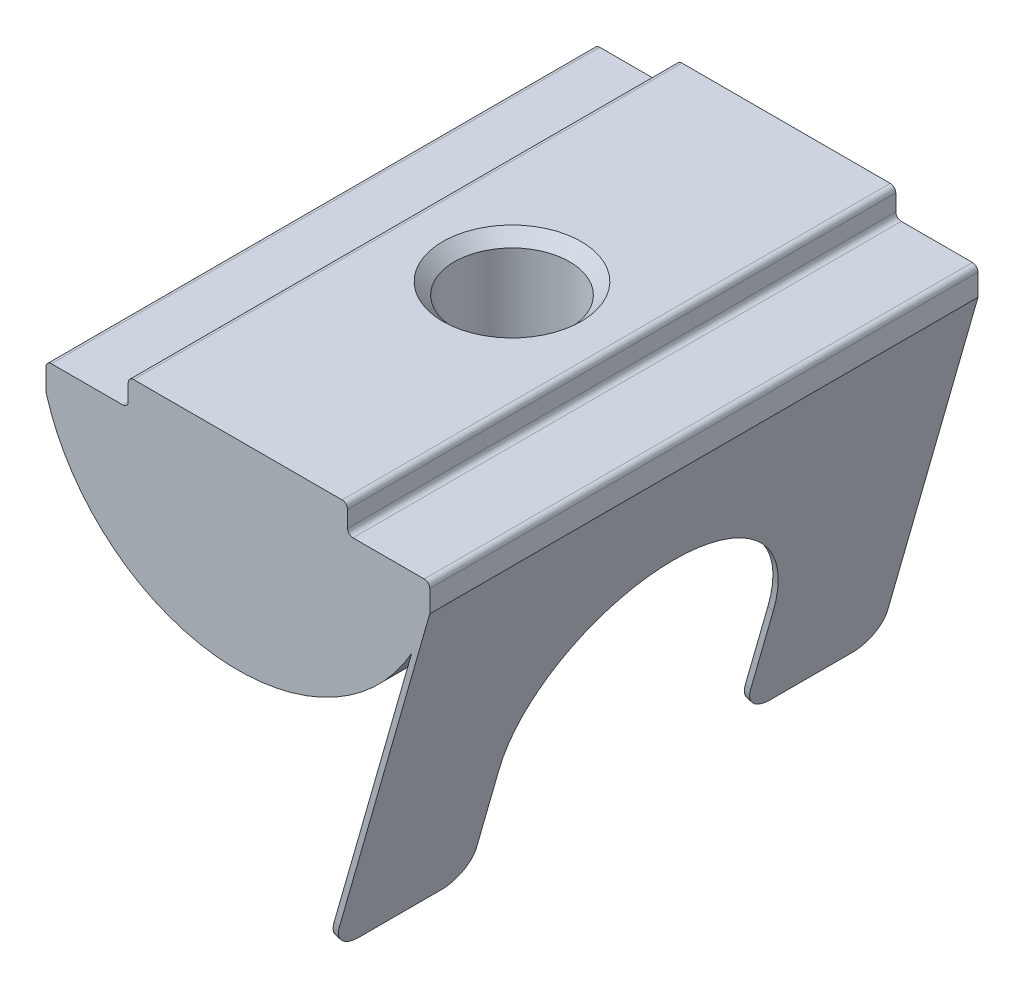
ISO-10303-21;
HEADER;
FILE_DESCRIPTION(('STEP AP214'),'2;1');
FILE_NAME('part.step','',(''),(''),'','','');
FILE_SCHEMA(('AUTOMOTIVE_DESIGN { 1 0 10303 214 1 1 1 1 }'));
ENDSEC;
DATA;
#1=APPLICATION_CONTEXT('core data for automotive mechanical design processes');
#2=APPLICATION_PROTOCOL_DEFINITION('international standard','automotive_design',2000,#1);
#3=PRODUCT_CONTEXT('',#1,'mechanical');
#4=PRODUCT('Part','Part','',(#3));
#5=PRODUCT_RELATED_PRODUCT_CATEGORY('part','',(#4));
#6=PRODUCT_DEFINITION_FORMATION('','',#4);
#7=PRODUCT_DEFINITION_CONTEXT('part definition',#1,'design');
#8=PRODUCT_DEFINITION('design','',#6,#7);
#9=PRODUCT_DEFINITION_SHAPE('','',#8);
#10=(LENGTH_UNIT() NAMED_UNIT(*) SI_UNIT(.MILLI.,.METRE.));
#11=(NAMED_UNIT(*) PLANE_ANGLE_UNIT() SI_UNIT($,.RADIAN.));
#12=(NAMED_UNIT(*) SI_UNIT($,.STERADIAN.) SOLID_ANGLE_UNIT());
#13=UNCERTAINTY_MEASURE_WITH_UNIT(LENGTH_MEASURE(1.E-05),#10,'distance_accuracy_value','');
#14=(GEOMETRIC_REPRESENTATION_CONTEXT(3) GLOBAL_UNCERTAINTY_ASSIGNED_CONTEXT((#13)) GLOBAL_UNIT_ASSIGNED_CONTEXT((#10,
#11,#12)) REPRESENTATION_CONTEXT('',''));
#15=CARTESIAN_POINT('',(0.,0.,0.));
#16=DIRECTION('',(0.,0.,1.));
#17=DIRECTION('',(1.,0.,0.));
#18=AXIS2_PLACEMENT_3D('',#15,#16,#17);
#19=CARTESIAN_POINT('',(3.23632054780592,-14.4448670937512,10.));
#20=DIRECTION('',(0.274721127897363,0.961523947640827,0.));
#21=DIRECTION('',(-0.961523947640827,0.274721127897363,0.));
#22=AXIS2_PLACEMENT_3D('',#19,#20,#21);
#23=PLANE('',#22);
#24=DIRECTION('',(0.,0.,-1.));
#25=VECTOR('',#24,1.);
#26=CARTESIAN_POINT('',(3.23632054780592,-14.4448670937512,10.));
#27=LINE('',#26,#25);
#28=CARTESIAN_POINT('',(3.23632054780592,-14.4448670937512,9.));
#29=VERTEX_POINT('',#28);
#30=CARTESIAN_POINT('',(3.23632054780592,-14.4448670937512,6.));
#31=VERTEX_POINT('',#30);
#32=EDGE_CURVE('E408',#29,#31,#27,.T.);
#33=ORIENTED_EDGE('',*,*,#32,.T.);
#34=DIRECTION('',(0.961523947640827,-0.274721127897363,0.));
#35=VECTOR('',#34,1.);
#36=CARTESIAN_POINT('',(3.23632054780592,-14.4448670937512,6.));
#37=LINE('',#36,#35);
#38=CARTESIAN_POINT('',(3.42862533733408,-14.4998113193307,6.));
#39=VERTEX_POINT('',#38);
#40=EDGE_CURVE('E364',#31,#39,#37,.T.);
#41=ORIENTED_EDGE('',*,*,#40,.T.);
#42=DIRECTION('',(0.,0.,-1.));
#43=VECTOR('',#42,1.);
#44=CARTESIAN_POINT('',(3.42862533733408,-14.4998113193307,10.));
#45=LINE('',#44,#43);
#46=CARTESIAN_POINT('',(3.42862533733408,-14.4998113193307,9.));
#47=VERTEX_POINT('',#46);
#48=EDGE_CURVE('E339',#47,#39,#45,.T.);
#49=ORIENTED_EDGE('',*,*,#48,.F.);
#50=DIRECTION('',(0.961523947640827,-0.274721127897363,0.));
#51=VECTOR('',#50,1.);
#52=CARTESIAN_POINT('',(3.23632054780592,-14.4448670937512,9.));
#53=LINE('',#52,#51);
#54=EDGE_CURVE('E362',#47,#29,#53,.F.);
#55=ORIENTED_EDGE('',*,*,#54,.T.);
#56=EDGE_LOOP('',(#33,#41,#49,#55));
#57=FACE_BOUND('',#56,.T.);
#58=ADVANCED_FACE('F37',(#57),#23,.F.);
#59=CARTESIAN_POINT('',(0.,0.,10.));
#60=DIRECTION('',(0.,0.,-1.));
#61=DIRECTION('',(-1.,0.,0.));
#62=AXIS2_PLACEMENT_3D('',#59,#60,#61);
#63=CYLINDRICAL_SURFACE('',#62,7.28010988928052);
#64=CARTESIAN_POINT('',(0.,-7.28010988928052,2.1));
#65=CARTESIAN_POINT('',(0.115405749101888,-7.28010858291426,2.09999807878451));
#66=CARTESIAN_POINT('',(0.23083115949619,-7.27733922137594,2.09045511172577));
#67=CARTESIAN_POINT('',(0.458333548661764,-7.26656163153758,2.05261766241584));
#68=CARTESIAN_POINT('',(0.570409295755617,-7.2585515003875,2.02431636923047));
#69=CARTESIAN_POINT('',(0.787897282696791,-7.23817237904811,1.94997643071092));
#70=CARTESIAN_POINT('',(0.893318673017077,-7.22580953541448,1.90396278884552));
#71=CARTESIAN_POINT('',(1.09494948218505,-7.19801761784187,1.79560336739001));
#72=CARTESIAN_POINT('',(1.19115788523723,-7.18258820636807,1.73325578969528));
#73=CARTESIAN_POINT('',(1.37420516893041,-7.14985463334501,1.59223965216657));
#74=CARTESIAN_POINT('',(1.4607626713683,-7.13251427660335,1.51321425982361));
#75=CARTESIAN_POINT('',(1.61959851865146,-7.09813486335544,1.34184702496666));
#76=CARTESIAN_POINT('',(1.69187467458009,-7.08109585340074,1.24950314486079));
#77=CARTESIAN_POINT('',(1.82153744129916,-7.04887009582828,1.05178798925506));
#78=CARTESIAN_POINT('',(1.87858772540365,-7.03372858268364,0.946188088751768));
#79=CARTESIAN_POINT('',(1.97400802519028,-7.00755006272637,0.726386569090322));
#80=CARTESIAN_POINT('',(2.01238214673458,-6.99651215388271,0.612186846941192));
#81=CARTESIAN_POINT('',(2.06835955734577,-6.98016653928316,0.381572192065173));
#82=CARTESIAN_POINT('',(2.08647860223091,-6.97471685534706,0.265292773595461));
#83=CARTESIAN_POINT('',(2.1030412019312,-6.96974167869436,0.0312267255348305));
#84=CARTESIAN_POINT('',(2.10148912345637,-6.97021487118302,-0.0865595637527045));
#85=CARTESIAN_POINT('',(2.07916018577878,-6.97690570133338,-0.31616364981322));
#86=CARTESIAN_POINT('',(2.05902135364714,-6.98293268350265,-0.428049957143066));
#87=CARTESIAN_POINT('',(2.00111819944654,-6.99974470092367,-0.646783429970681));
#88=CARTESIAN_POINT('',(1.96335225645983,-7.01053017374194,-0.753630131051575));
#89=CARTESIAN_POINT('',(1.87077934264262,-7.03580155137298,-0.960848523218984));
#90=CARTESIAN_POINT('',(1.81575950227368,-7.05033325315028,-1.06111929398638));
#91=CARTESIAN_POINT('',(1.69038871863649,-7.081436793486,-1.25122251806876));
#92=CARTESIAN_POINT('',(1.62003430457955,-7.09800909353824,-1.34105260119598));
#93=CARTESIAN_POINT('',(1.46278911767419,-7.13210713535711,-1.51135315985924));
#94=CARTESIAN_POINT('',(1.37536652675878,-7.14964503621975,-1.59133094291755));
#95=CARTESIAN_POINT('',(1.18813245379409,-7.18313114205818,-1.73560052267178));
#96=CARTESIAN_POINT('',(1.08832030525625,-7.19907926142939,-1.79989147495215));
#97=CARTESIAN_POINT('',(0.878292717913073,-7.22771641245845,-1.91123148613496));
#98=CARTESIAN_POINT('',(0.768020360636591,-7.24038602835346,-1.95817850173403));
#99=CARTESIAN_POINT('',(0.540696468298719,-7.26089875180453,-2.03271867385901));
#100=CARTESIAN_POINT('',(0.423646684544826,-7.26874310018828,-2.06031680624624));
#101=CARTESIAN_POINT('',(0.190284802476668,-7.27852824799782,-2.09457236405778));
#102=CARTESIAN_POINT('',(0.074078579183897,-7.28065742774975,-2.1018982535686));
#103=CARTESIAN_POINT('',(-0.157906852005878,-7.27932103452248,-2.09726509423185));
#104=CARTESIAN_POINT('',(-0.273686110475629,-7.27585614696932,-2.08530840802673));
#105=CARTESIAN_POINT('',(-0.499057244308963,-7.26384373495676,-2.04299308010332));
#106=CARTESIAN_POINT('',(-0.608727453995218,-7.25540240647546,-2.01301867685203));
#107=CARTESIAN_POINT('',(-0.821463707693299,-7.2344061928547,-1.93597527630382));
#108=CARTESIAN_POINT('',(-0.924528980116744,-7.22185082815728,-1.88890428605167));
#109=CARTESIAN_POINT('',(-1.12363900306459,-7.19359273373252,-1.7778400586876));
#110=CARTESIAN_POINT('',(-1.21948013593821,-7.17782700001637,-1.71349823723685));
#111=CARTESIAN_POINT('',(-1.39923543414521,-7.14496353712808,-1.57014741443378));
#112=CARTESIAN_POINT('',(-1.48314682570729,-7.12786549960936,-1.49113501185603));
#113=CARTESIAN_POINT('',(-1.63956003046531,-7.09355178284333,-1.31755086830164));
#114=CARTESIAN_POINT('',(-1.71158738320311,-7.07635123454374,-1.22254772608087));
#115=CARTESIAN_POINT('',(-1.8387024365619,-7.04439386615432,-1.02143137272161));
#116=CARTESIAN_POINT('',(-1.89379070282203,-7.02963696447253,-0.915318532722799));
#117=CARTESIAN_POINT('',(-1.98506590481791,-7.00440989753697,-0.695417901166871));
#118=CARTESIAN_POINT('',(-2.02135104977912,-6.99391752189628,-0.5816735656722));
#119=CARTESIAN_POINT('',(-2.074161475271,-6.97844008689408,-0.34933511476111));
#120=CARTESIAN_POINT('',(-2.09069288822828,-6.97345331838672,-0.230742516288877));
#121=CARTESIAN_POINT('',(-2.103131726553,-6.9697111531282,0.00302369700059278));
#122=CARTESIAN_POINT('',(-2.09980847752584,-6.9707232988933,0.11815321613582));
#123=CARTESIAN_POINT('',(-2.07445015698224,-6.97831125022504,0.346136404991692));
#124=CARTESIAN_POINT('',(-2.05241573258415,-6.98488686338141,0.458990153280757));
#125=CARTESIAN_POINT('',(-1.9907398656865,-7.00271097219101,0.678064886124634));
#126=CARTESIAN_POINT('',(-1.95128753251785,-7.0139091966799,0.784343497528719));
#127=CARTESIAN_POINT('',(-1.85604214360921,-7.03971100395502,0.988857207217537));
#128=CARTESIAN_POINT('',(-1.80024614981728,-7.05431519892629,1.08709085521644));
#129=CARTESIAN_POINT('',(-1.67167566569245,-7.08590272601167,1.27633324535469));
#130=CARTESIAN_POINT('',(-1.59838886496739,-7.10295001814609,1.36698326577315));
#131=CARTESIAN_POINT('',(-1.43785784394902,-7.137176593541,1.53494814700353));
#132=CARTESIAN_POINT('',(-1.35061009386651,-7.1543559091329,1.61225962509063));
#133=CARTESIAN_POINT('',(-1.16186626652759,-7.18745248600665,1.7533713345945));
#134=CARTESIAN_POINT('',(-1.06005565502265,-7.20332463849074,1.81676246863141));
#135=CARTESIAN_POINT('',(-0.84676413252408,-7.23149570467293,1.92543452155755));
#136=CARTESIAN_POINT('',(-0.735288403103954,-7.24379651780926,1.97072507219482));
#137=CARTESIAN_POINT('',(-0.520478136554753,-7.26217676574041,2.03717729648336));
#138=CARTESIAN_POINT('',(-0.417911702677488,-7.26884853519877,2.06067537157275));
#139=CARTESIAN_POINT('',(-0.210235379170869,-7.27781538630797,2.09208650993655));
#140=CARTESIAN_POINT('',(-0.105125846880893,-7.28011107928067,2.10000175008097));
#141=CARTESIAN_POINT('',(0.,-7.28010988928052,2.1));
#142=B_SPLINE_CURVE_WITH_KNOTS('',3,(#64,#65,#66,#67,#68,#69,#70,#71,#72,#73,#74,#75,#76,#77,
#78,#79,#80,#81,#82,#83,#84,#85,#86,#87,#88,#89,#90,#91,#92,#93,#94,#95,#96,#97,#98,#99,#100,
#101,#102,#103,#104,#105,#106,#107,#108,#109,#110,#111,#112,#113,#114,#115,#116,#117,#118,#119,
#120,#121,#122,#123,#124,#125,#126,#127,#128,#129,#130,#131,#132,#133,#134,#135,#136,#137,#138,
#139,#140,#141),.UNSPECIFIED.,.T.,.F.,(4,2,2,2,2,2,2,2,2,2,2,2,2,2,2,2,2,2,2,2,2,2,2,2,2,2,2,2,
2,2,2,2,2,2,2,2,2,2,4),(0.,0.345831323970082,0.691788284184989,1.03725865795166,
1.38276707846294,1.73659470038711,2.09047651183883,2.45162710971022,2.81269827449967,
3.16434975425982,3.51592317375278,3.85585976124289,4.19582761408587,4.54016676885096,
4.88458394155291,5.24224417783296,5.59992366256847,5.95967525385422,6.31933429554573,
6.66698389205993,7.01459089523478,7.35503564429435,7.69552009186318,8.04347404639917,
8.39150877148625,8.75116319953422,9.11080561650259,9.46855018213421,9.8261836592517,
10.1700518370971,10.5139081228867,10.8541195481968,11.1943921698901,11.5462222337392,
11.8981413928139,12.2593215514066,12.6203092607871,12.9353792720195,13.2504052658996),.UNSPECIFIED.);
#143=CARTESIAN_POINT('',(0.,-7.28010988928052,2.1));
#144=VERTEX_POINT('',#143);
#145=EDGE_CURVE('E273',#144,#144,#142,.T.);
#146=ORIENTED_EDGE('',*,*,#145,.T.);
#147=EDGE_LOOP('',(#146));
#148=FACE_BOUND('',#147,.T.);
#149=DIRECTION('',(0.,0.,-1.));
#150=VECTOR('',#149,1.);
#151=CARTESIAN_POINT('',(6.3421224080087,-3.57456058304149,10.));
#152=LINE('',#151,#150);
#153=CARTESIAN_POINT('',(6.3421224080087,-3.57456058304149,10.));
#154=VERTEX_POINT('',#153);
#155=CARTESIAN_POINT('',(6.3421224080087,-3.57456058304149,-10.));
#156=VERTEX_POINT('',#155);
#157=EDGE_CURVE('E410',#154,#156,#152,.T.);
#158=ORIENTED_EDGE('',*,*,#157,.F.);
#159=CARTESIAN_POINT('',(0.,0.,10.));
#160=DIRECTION('',(0.,0.,1.));
#161=DIRECTION('',(1.,0.,0.));
#162=AXIS2_PLACEMENT_3D('',#159,#160,#161);
#163=CIRCLE('',#162,7.28010988928052);
#164=CARTESIAN_POINT('',(-7.,-2.,10.));
#165=VERTEX_POINT('',#164);
#166=EDGE_CURVE('E238',#165,#154,#163,.T.);
#167=ORIENTED_EDGE('',*,*,#166,.F.);
#168=DIRECTION('',(0.,0.,-1.));
#169=VECTOR('',#168,1.);
#170=CARTESIAN_POINT('',(-7.,-2.,10.));
#171=LINE('',#170,#169);
#172=CARTESIAN_POINT('',(-7.,-2.,-10.));
#173=VERTEX_POINT('',#172);
#174=EDGE_CURVE('E232',#165,#173,#171,.T.);
#175=ORIENTED_EDGE('',*,*,#174,.T.);
#176=CARTESIAN_POINT('',(0.,0.,-10.));
#177=DIRECTION('',(0.,0.,1.));
#178=DIRECTION('',(1.,0.,0.));
#179=AXIS2_PLACEMENT_3D('',#176,#177,#178);
#180=CIRCLE('',#179,7.28010988928052);
#181=EDGE_CURVE('E262',#173,#156,#180,.T.);
#182=ORIENTED_EDGE('',*,*,#181,.T.);
#183=EDGE_LOOP('',(#158,#167,#175,#182));
#184=FACE_BOUND('',#183,.T.);
#185=ADVANCED_FACE('F283',(#148,#184),#63,.T.);
#186=CARTESIAN_POINT('',(4.,-0.999999999999999,10.));
#187=DIRECTION('',(-1.,0.,0.));
#188=DIRECTION('',(0.,0.,1.));
#189=AXIS2_PLACEMENT_3D('',#186,#187,#188);
#190=PLANE('',#189);
#191=DIRECTION('',(0.,1.,0.));
#192=VECTOR('',#191,1.);
#193=CARTESIAN_POINT('',(4.,-0.999999999999999,10.));
#194=LINE('',#193,#192);
#195=CARTESIAN_POINT('',(4.,-0.799999999999999,10.));
#196=VERTEX_POINT('',#195);
#197=CARTESIAN_POINT('',(4.,-0.2,10.));
#198=VERTEX_POINT('',#197);
#199=EDGE_CURVE('E269',#196,#198,#194,.T.);
#200=ORIENTED_EDGE('',*,*,#199,.F.);
#201=DIRECTION('',(0.,0.,-1.));
#202=VECTOR('',#201,1.);
#203=CARTESIAN_POINT('',(4.,-0.799999999999999,-10.));
#204=LINE('',#203,#202);
#205=CARTESIAN_POINT('',(4.,-0.799999999999999,-10.));
#206=VERTEX_POINT('',#205);
#207=EDGE_CURVE('E488',#196,#206,#204,.T.);
#208=ORIENTED_EDGE('',*,*,#207,.T.);
#209=DIRECTION('',(0.,1.,0.));
#210=VECTOR('',#209,1.);
#211=CARTESIAN_POINT('',(4.,-0.999999999999999,-10.));
#212=LINE('',#211,#210);
#213=CARTESIAN_POINT('',(4.,-0.2,-10.));
#214=VERTEX_POINT('',#213);
#215=EDGE_CURVE('E247',#206,#214,#212,.T.);
#216=ORIENTED_EDGE('',*,*,#215,.T.);
#217=DIRECTION('',(0.,0.,-1.));
#218=VECTOR('',#217,1.);
#219=CARTESIAN_POINT('',(4.,-0.2,10.));
#220=LINE('',#219,#218);
#221=EDGE_CURVE('E491',#214,#198,#220,.F.);
#222=ORIENTED_EDGE('',*,*,#221,.T.);
#223=EDGE_LOOP('',(#200,#208,#216,#222));
#224=FACE_BOUND('',#223,.T.);
#225=ADVANCED_FACE('F318',(#224),#190,.F.);
#226=CARTESIAN_POINT('',(-4.,0.,10.));
#227=DIRECTION('',(0.,-1.,0.));
#228=DIRECTION('',(0.,0.,-1.));
#229=AXIS2_PLACEMENT_3D('',#226,#227,#228);
#230=PLANE('',#229);
#231=CARTESIAN_POINT('',(0.,0.,0.));
#232=DIRECTION('',(0.,1.,0.));
#233=DIRECTION('',(0.,0.,1.));
#234=AXIS2_PLACEMENT_3D('',#231,#232,#233);
#235=CIRCLE('',#234,2.525);
#236=CARTESIAN_POINT('',(0.,0.,2.525));
#237=VERTEX_POINT('',#236);
#238=EDGE_CURVE('E413',#237,#237,#235,.T.);
#239=ORIENTED_EDGE('',*,*,#238,.F.);
#240=EDGE_LOOP('',(#239));
#241=FACE_BOUND('',#240,.T.);
#242=DIRECTION('',(-1.,0.,0.));
#243=VECTOR('',#242,1.);
#244=CARTESIAN_POINT('',(-4.,0.,10.));
#245=LINE('',#244,#243);
#246=CARTESIAN_POINT('',(3.8,0.,10.));
#247=VERTEX_POINT('',#246);
#248=CARTESIAN_POINT('',(-3.8,0.,10.));
#249=VERTEX_POINT('',#248);
#250=EDGE_CURVE('E420',#247,#249,#245,.T.);
#251=ORIENTED_EDGE('',*,*,#250,.F.);
#252=DIRECTION('',(0.,0.,-1.));
#253=VECTOR('',#252,1.);
#254=CARTESIAN_POINT('',(3.8,0.,10.));
#255=LINE('',#254,#253);
#256=CARTESIAN_POINT('',(3.8,0.,-10.));
#257=VERTEX_POINT('',#256);
#258=EDGE_CURVE('E483',#247,#257,#255,.T.);
#259=ORIENTED_EDGE('',*,*,#258,.T.);
#260=DIRECTION('',(-1.,0.,0.));
#261=VECTOR('',#260,1.);
#262=CARTESIAN_POINT('',(-4.,0.,-10.));
#263=LINE('',#262,#261);
#264=CARTESIAN_POINT('',(-3.8,0.,-10.));
#265=VERTEX_POINT('',#264);
#266=EDGE_CURVE('E250',#257,#265,#263,.T.);
#267=ORIENTED_EDGE('',*,*,#266,.T.);
#268=DIRECTION('',(0.,0.,-1.));
#269=VECTOR('',#268,1.);
#270=CARTESIAN_POINT('',(-3.8,0.,10.));
#271=LINE('',#270,#269);
#272=EDGE_CURVE('E486',#265,#249,#271,.F.);
#273=ORIENTED_EDGE('',*,*,#272,.T.);
#274=EDGE_LOOP('',(#251,#259,#267,#273));
#275=FACE_BOUND('',#274,.T.);
#276=ADVANCED_FACE('F529',(#241,#275),#230,.F.);
#277=CARTESIAN_POINT('',(-4.,0.,10.));
#278=DIRECTION('',(1.,0.,0.));
#279=DIRECTION('',(0.,0.,-1.));
#280=AXIS2_PLACEMENT_3D('',#277,#278,#279);
#281=PLANE('',#280);
#282=DIRECTION('',(0.,-1.,0.));
#283=VECTOR('',#282,1.);
#284=CARTESIAN_POINT('',(-4.,0.,-10.));
#285=LINE('',#284,#283);
#286=CARTESIAN_POINT('',(-4.,-0.2,-10.));
#287=VERTEX_POINT('',#286);
#288=CARTESIAN_POINT('',(-4.,-0.8,-10.));
#289=VERTEX_POINT('',#288);
#290=EDGE_CURVE('E254',#287,#289,#285,.T.);
#291=ORIENTED_EDGE('',*,*,#290,.T.);
#292=DIRECTION('',(0.,0.,-1.));
#293=VECTOR('',#292,1.);
#294=CARTESIAN_POINT('',(-4.,-0.8,10.));
#295=LINE('',#294,#293);
#296=CARTESIAN_POINT('',(-4.,-0.8,10.));
#297=VERTEX_POINT('',#296);
#298=EDGE_CURVE('E471',#289,#297,#295,.F.);
#299=ORIENTED_EDGE('',*,*,#298,.T.);
#300=DIRECTION('',(0.,-1.,0.));
#301=VECTOR('',#300,1.);
#302=CARTESIAN_POINT('',(-4.,0.,10.));
#303=LINE('',#302,#301);
#304=CARTESIAN_POINT('',(-4.,-0.2,10.));
#305=VERTEX_POINT('',#304);
#306=EDGE_CURVE('E423',#305,#297,#303,.T.);
#307=ORIENTED_EDGE('',*,*,#306,.F.);
#308=DIRECTION('',(0.,0.,-1.));
#309=VECTOR('',#308,1.);
#310=CARTESIAN_POINT('',(-4.,-0.2,10.));
#311=LINE('',#310,#309);
#312=EDGE_CURVE('E473',#305,#287,#311,.T.);
#313=ORIENTED_EDGE('',*,*,#312,.T.);
#314=EDGE_LOOP('',(#291,#299,#307,#313));
#315=FACE_BOUND('',#314,.T.);
#316=ADVANCED_FACE('F538',(#315),#281,.F.);
#317=CARTESIAN_POINT('',(-4.,-1.,10.));
#318=DIRECTION('',(0.,-1.,0.));
#319=DIRECTION('',(1.,0.,0.));
#320=AXIS2_PLACEMENT_3D('',#317,#318,#319);
#321=PLANE('',#320);
#322=DIRECTION('',(-1.,0.,0.));
#323=VECTOR('',#322,1.);
#324=CARTESIAN_POINT('',(-4.,-1.,-10.));
#325=LINE('',#324,#323);
#326=CARTESIAN_POINT('',(-4.2,-1.,-10.));
#327=VERTEX_POINT('',#326);
#328=CARTESIAN_POINT('',(-6.8,-1.,-10.));
#329=VERTEX_POINT('',#328);
#330=EDGE_CURVE('E257',#327,#329,#325,.T.);
#331=ORIENTED_EDGE('',*,*,#330,.T.);
#332=DIRECTION('',(0.,0.,-1.));
#333=VECTOR('',#332,1.);
#334=CARTESIAN_POINT('',(-6.8,-1.,10.));
#335=LINE('',#334,#333);
#336=CARTESIAN_POINT('',(-6.8,-1.,10.));
#337=VERTEX_POINT('',#336);
#338=EDGE_CURVE('E476',#329,#337,#335,.F.);
#339=ORIENTED_EDGE('',*,*,#338,.T.);
#340=DIRECTION('',(-1.,0.,0.));
#341=VECTOR('',#340,1.);
#342=CARTESIAN_POINT('',(-4.,-1.,10.));
#343=LINE('',#342,#341);
#344=CARTESIAN_POINT('',(-4.2,-1.,10.));
#345=VERTEX_POINT('',#344);
#346=EDGE_CURVE('E426',#345,#337,#343,.T.);
#347=ORIENTED_EDGE('',*,*,#346,.F.);
#348=DIRECTION('',(0.,0.,-1.));
#349=VECTOR('',#348,1.);
#350=CARTESIAN_POINT('',(-4.2,-1.,-10.));
#351=LINE('',#350,#349);
#352=EDGE_CURVE('E478',#345,#327,#351,.T.);
#353=ORIENTED_EDGE('',*,*,#352,.T.);
#354=EDGE_LOOP('',(#331,#339,#347,#353));
#355=FACE_BOUND('',#354,.T.);
#356=ADVANCED_FACE('F309',(#355),#321,.F.);
#357=CARTESIAN_POINT('',(-7.,-1.,10.));
#358=DIRECTION('',(1.,0.,0.));
#359=DIRECTION('',(0.,1.,0.));
#360=AXIS2_PLACEMENT_3D('',#357,#358,#359);
#361=PLANE('',#360);
#362=DIRECTION('',(0.,-1.,0.));
#363=VECTOR('',#362,1.);
#364=CARTESIAN_POINT('',(-7.,-1.,10.));
#365=LINE('',#364,#363);
#366=CARTESIAN_POINT('',(-7.,-1.2,10.));
#367=VERTEX_POINT('',#366);
#368=EDGE_CURVE('E243',#367,#165,#365,.T.);
#369=ORIENTED_EDGE('',*,*,#368,.F.);
#370=DIRECTION('',(0.,0.,-1.));
#371=VECTOR('',#370,1.);
#372=CARTESIAN_POINT('',(-7.,-1.2,10.));
#373=LINE('',#372,#371);
#374=CARTESIAN_POINT('',(-7.,-1.2,-10.));
#375=VERTEX_POINT('',#374);
#376=EDGE_CURVE('E481',#367,#375,#373,.T.);
#377=ORIENTED_EDGE('',*,*,#376,.T.);
#378=DIRECTION('',(0.,-1.,0.));
#379=VECTOR('',#378,1.);
#380=CARTESIAN_POINT('',(-7.,-1.,-10.));
#381=LINE('',#380,#379);
#382=EDGE_CURVE('E260',#375,#173,#381,.T.);
#383=ORIENTED_EDGE('',*,*,#382,.T.);
#384=ORIENTED_EDGE('',*,*,#174,.F.);
#385=EDGE_LOOP('',(#369,#377,#383,#384));
#386=FACE_BOUND('',#385,.T.);
#387=ADVANCED_FACE('F305',(#386),#361,.F.);
#388=CARTESIAN_POINT('',(7.,-0.999999999999999,10.));
#389=DIRECTION('',(-1.,0.,0.));
#390=DIRECTION('',(0.,0.,1.));
#391=AXIS2_PLACEMENT_3D('',#388,#389,#390);
#392=PLANE('',#391);
#393=DIRECTION('',(0.,1.,0.));
#394=VECTOR('',#393,1.);
#395=CARTESIAN_POINT('',(7.,-0.999999999999999,-10.));
#396=LINE('',#395,#394);
#397=CARTESIAN_POINT('',(7.,-2.,-10.));
#398=VERTEX_POINT('',#397);
#399=CARTESIAN_POINT('',(7.,-1.2,-10.));
#400=VERTEX_POINT('',#399);
#401=EDGE_CURVE('E265',#398,#400,#396,.T.);
#402=ORIENTED_EDGE('',*,*,#401,.T.);
#403=DIRECTION('',(0.,0.,-1.));
#404=VECTOR('',#403,1.);
#405=CARTESIAN_POINT('',(7.,-1.2,10.));
#406=LINE('',#405,#404);
#407=CARTESIAN_POINT('',(7.,-1.2,10.));
#408=VERTEX_POINT('',#407);
#409=EDGE_CURVE('E237',#400,#408,#406,.F.);
#410=ORIENTED_EDGE('',*,*,#409,.T.);
#411=DIRECTION('',(0.,1.,0.));
#412=VECTOR('',#411,1.);
#413=CARTESIAN_POINT('',(7.,-0.999999999999999,10.));
#414=LINE('',#413,#412);
#415=CARTESIAN_POINT('',(7.,-2.,10.));
#416=VERTEX_POINT('',#415);
#417=EDGE_CURVE('E216',#416,#408,#414,.T.);
#418=ORIENTED_EDGE('',*,*,#417,.F.);
#419=DIRECTION('',(0.,0.,-1.));
#420=VECTOR('',#419,1.);
#421=CARTESIAN_POINT('',(7.,-2.,10.));
#422=LINE('',#421,#420);
#423=EDGE_CURVE('E224',#416,#398,#422,.T.);
#424=ORIENTED_EDGE('',*,*,#423,.T.);
#425=EDGE_LOOP('',(#402,#410,#418,#424));
#426=FACE_BOUND('',#425,.T.);
#427=ADVANCED_FACE('F235',(#426),#392,.F.);
#428=CARTESIAN_POINT('',(4.,-0.999999999999999,10.));
#429=DIRECTION('',(0.,-1.,0.));
#430=DIRECTION('',(1.,0.,0.));
#431=AXIS2_PLACEMENT_3D('',#428,#429,#430);
#432=PLANE('',#431);
#433=DIRECTION('',(-1.,0.,0.));
#434=VECTOR('',#433,1.);
#435=CARTESIAN_POINT('',(4.,-0.999999999999999,10.));
#436=LINE('',#435,#434);
#437=CARTESIAN_POINT('',(6.8,-0.999999999999999,10.));
#438=VERTEX_POINT('',#437);
#439=CARTESIAN_POINT('',(4.2,-0.999999999999999,10.));
#440=VERTEX_POINT('',#439);
#441=EDGE_CURVE('E233',#438,#440,#436,.T.);
#442=ORIENTED_EDGE('',*,*,#441,.F.);
#443=DIRECTION('',(0.,0.,-1.));
#444=VECTOR('',#443,1.);
#445=CARTESIAN_POINT('',(6.8,-0.999999999999999,10.));
#446=LINE('',#445,#444);
#447=CARTESIAN_POINT('',(6.8,-0.999999999999999,-10.));
#448=VERTEX_POINT('',#447);
#449=EDGE_CURVE('E508',#438,#448,#446,.T.);
#450=ORIENTED_EDGE('',*,*,#449,.T.);
#451=DIRECTION('',(-1.,0.,0.));
#452=VECTOR('',#451,1.);
#453=CARTESIAN_POINT('',(4.,-0.999999999999999,-10.));
#454=LINE('',#453,#452);
#455=CARTESIAN_POINT('',(4.2,-0.999999999999999,-10.));
#456=VERTEX_POINT('',#455);
#457=EDGE_CURVE('E267',#448,#456,#454,.T.);
#458=ORIENTED_EDGE('',*,*,#457,.T.);
#459=DIRECTION('',(0.,0.,-1.));
#460=VECTOR('',#459,1.);
#461=CARTESIAN_POINT('',(4.2,-0.999999999999999,10.));
#462=LINE('',#461,#460);
#463=EDGE_CURVE('E281',#456,#440,#462,.F.);
#464=ORIENTED_EDGE('',*,*,#463,.T.);
#465=EDGE_LOOP('',(#442,#450,#458,#464));
#466=FACE_BOUND('',#465,.T.);
#467=ADVANCED_FACE('F298',(#466),#432,.F.);
#468=CARTESIAN_POINT('',(0.,0.,10.));
#469=DIRECTION('',(0.,0.,1.));
#470=DIRECTION('',(1.,0.,0.));
#471=AXIS2_PLACEMENT_3D('',#468,#469,#470);
#472=PLANE('',#471);
#473=DIRECTION('',(-0.274721127897378,-0.961523947640823,0.));
#474=VECTOR('',#473,1.);
#475=CARTESIAN_POINT('',(6.80769521047183,-1.94505577442053,10.));
#476=LINE('',#475,#474);
#477=CARTESIAN_POINT('',(3.51104167570329,-13.4833431461104,10.));
#478=VERTEX_POINT('',#477);
#479=EDGE_CURVE('E221',#154,#478,#476,.T.);
#480=ORIENTED_EDGE('',*,*,#479,.T.);
#481=DIRECTION('',(0.961523947640827,-0.274721127897363,0.));
#482=VECTOR('',#481,1.);
#483=CARTESIAN_POINT('',(3.70334646523145,-13.5382873716899,10.));
#484=LINE('',#483,#482);
#485=CARTESIAN_POINT('',(3.70334646523146,-13.5382873716899,10.));
#486=VERTEX_POINT('',#485);
#487=EDGE_CURVE('E219',#478,#486,#484,.T.);
#488=ORIENTED_EDGE('',*,*,#487,.T.);
#489=DIRECTION('',(0.274721127897378,0.961523947640823,0.));
#490=VECTOR('',#489,1.);
#491=CARTESIAN_POINT('',(7.,-2.,10.));
#492=LINE('',#491,#490);
#493=EDGE_CURVE('E211',#486,#416,#492,.T.);
#494=ORIENTED_EDGE('',*,*,#493,.T.);
#495=ORIENTED_EDGE('',*,*,#417,.T.);
#496=CARTESIAN_POINT('',(6.8,-1.2,10.));
#497=DIRECTION('',(0.,0.,1.));
#498=DIRECTION('',(1.,0.,0.));
#499=AXIS2_PLACEMENT_3D('',#496,#497,#498);
#500=CIRCLE('',#499,0.2);
#501=EDGE_CURVE('E493',#408,#438,#500,.T.);
#502=ORIENTED_EDGE('',*,*,#501,.T.);
#503=ORIENTED_EDGE('',*,*,#441,.T.);
#504=CARTESIAN_POINT('',(4.2,-0.799999999999999,10.));
#505=DIRECTION('',(0.,0.,1.));
#506=DIRECTION('',(1.,0.,0.));
#507=AXIS2_PLACEMENT_3D('',#504,#505,#506);
#508=CIRCLE('',#507,0.2);
#509=EDGE_CURVE('E467',#440,#196,#508,.F.);
#510=ORIENTED_EDGE('',*,*,#509,.T.);
#511=ORIENTED_EDGE('',*,*,#199,.T.);
#512=CARTESIAN_POINT('',(3.8,-0.2,10.));
#513=DIRECTION('',(0.,0.,1.));
#514=DIRECTION('',(1.,0.,0.));
#515=AXIS2_PLACEMENT_3D('',#512,#513,#514);
#516=CIRCLE('',#515,0.2);
#517=EDGE_CURVE('E495',#198,#247,#516,.T.);
#518=ORIENTED_EDGE('',*,*,#517,.T.);
#519=ORIENTED_EDGE('',*,*,#250,.T.);
#520=CARTESIAN_POINT('',(-3.8,-0.2,10.));
#521=DIRECTION('',(0.,0.,1.));
#522=DIRECTION('',(1.,0.,0.));
#523=AXIS2_PLACEMENT_3D('',#520,#521,#522);
#524=CIRCLE('',#523,0.2);
#525=EDGE_CURVE('E498',#249,#305,#524,.T.);
#526=ORIENTED_EDGE('',*,*,#525,.T.);
#527=ORIENTED_EDGE('',*,*,#306,.T.);
#528=CARTESIAN_POINT('',(-4.2,-0.8,10.));
#529=DIRECTION('',(0.,0.,1.));
#530=DIRECTION('',(1.,0.,0.));
#531=AXIS2_PLACEMENT_3D('',#528,#529,#530);
#532=CIRCLE('',#531,0.2);
#533=EDGE_CURVE('E463',#297,#345,#532,.F.);
#534=ORIENTED_EDGE('',*,*,#533,.T.);
#535=ORIENTED_EDGE('',*,*,#346,.T.);
#536=CARTESIAN_POINT('',(-6.8,-1.2,10.));
#537=DIRECTION('',(0.,0.,1.));
#538=DIRECTION('',(1.,0.,0.));
#539=AXIS2_PLACEMENT_3D('',#536,#537,#538);
#540=CIRCLE('',#539,0.2);
#541=EDGE_CURVE('E432',#337,#367,#540,.T.);
#542=ORIENTED_EDGE('',*,*,#541,.T.);
#543=ORIENTED_EDGE('',*,*,#368,.T.);
#544=ORIENTED_EDGE('',*,*,#166,.T.);
#545=EDGE_LOOP('',(#480,#488,#494,#495,#502,#503,#510,#511,#518,#519,#526,#527,#534,#535,#542,
#543,#544));
#546=FACE_BOUND('',#545,.T.);
#547=ADVANCED_FACE('F214',(#546),#472,.T.);
#548=CARTESIAN_POINT('',(0.,0.,-10.));
#549=DIRECTION('',(0.,0.,1.));
#550=DIRECTION('',(1.,0.,0.));
#551=AXIS2_PLACEMENT_3D('',#548,#549,#550);
#552=PLANE('',#551);
#553=DIRECTION('',(0.274721127897378,0.961523947640823,0.));
#554=VECTOR('',#553,1.);
#555=CARTESIAN_POINT('',(7.,-2.,-10.));
#556=LINE('',#555,#554);
#557=CARTESIAN_POINT('',(3.70334646523146,-13.5382873716899,-10.));
#558=VERTEX_POINT('',#557);
#559=EDGE_CURVE('E228',#558,#398,#556,.T.);
#560=ORIENTED_EDGE('',*,*,#559,.F.);
#561=DIRECTION('',(0.961523947640827,-0.274721127897363,0.));
#562=VECTOR('',#561,1.);
#563=CARTESIAN_POINT('',(-3.29665353476839,-11.53828737169,-10.));
#564=LINE('',#563,#562);
#565=CARTESIAN_POINT('',(3.51104167570329,-13.4833431461104,-10.));
#566=VERTEX_POINT('',#565);
#567=EDGE_CURVE('E360',#558,#566,#564,.F.);
#568=ORIENTED_EDGE('',*,*,#567,.T.);
#569=DIRECTION('',(-0.274721127897378,-0.961523947640823,0.));
#570=VECTOR('',#569,1.);
#571=CARTESIAN_POINT('',(6.80769521047183,-1.94505577442053,-10.));
#572=LINE('',#571,#570);
#573=EDGE_CURVE('E386',#156,#566,#572,.T.);
#574=ORIENTED_EDGE('',*,*,#573,.F.);
#575=ORIENTED_EDGE('',*,*,#181,.F.);
#576=ORIENTED_EDGE('',*,*,#382,.F.);
#577=CARTESIAN_POINT('',(-6.8,-1.2,-10.));
#578=DIRECTION('',(0.,0.,1.));
#579=DIRECTION('',(1.,0.,0.));
#580=AXIS2_PLACEMENT_3D('',#577,#578,#579);
#581=CIRCLE('',#580,0.2);
#582=EDGE_CURVE('E505',#375,#329,#581,.F.);
#583=ORIENTED_EDGE('',*,*,#582,.T.);
#584=ORIENTED_EDGE('',*,*,#330,.F.);
#585=CARTESIAN_POINT('',(-4.2,-0.8,-10.));
#586=DIRECTION('',(0.,0.,1.));
#587=DIRECTION('',(1.,0.,0.));
#588=AXIS2_PLACEMENT_3D('',#585,#586,#587);
#589=CIRCLE('',#588,0.2);
#590=EDGE_CURVE('E465',#327,#289,#589,.T.);
#591=ORIENTED_EDGE('',*,*,#590,.T.);
#592=ORIENTED_EDGE('',*,*,#290,.F.);
#593=CARTESIAN_POINT('',(-3.8,-0.2,-10.));
#594=DIRECTION('',(0.,0.,1.));
#595=DIRECTION('',(1.,0.,0.));
#596=AXIS2_PLACEMENT_3D('',#593,#594,#595);
#597=CIRCLE('',#596,0.2);
#598=EDGE_CURVE('E507',#287,#265,#597,.F.);
#599=ORIENTED_EDGE('',*,*,#598,.T.);
#600=ORIENTED_EDGE('',*,*,#266,.F.);
#601=CARTESIAN_POINT('',(3.8,-0.2,-10.));
#602=DIRECTION('',(0.,0.,1.));
#603=DIRECTION('',(1.,0.,0.));
#604=AXIS2_PLACEMENT_3D('',#601,#602,#603);
#605=CIRCLE('',#604,0.2);
#606=EDGE_CURVE('E503',#257,#214,#605,.F.);
#607=ORIENTED_EDGE('',*,*,#606,.T.);
#608=ORIENTED_EDGE('',*,*,#215,.F.);
#609=CARTESIAN_POINT('',(4.2,-0.799999999999999,-10.));
#610=DIRECTION('',(0.,0.,1.));
#611=DIRECTION('',(1.,0.,0.));
#612=AXIS2_PLACEMENT_3D('',#609,#610,#611);
#613=CIRCLE('',#612,0.2);
#614=EDGE_CURVE('E469',#206,#456,#613,.T.);
#615=ORIENTED_EDGE('',*,*,#614,.T.);
#616=ORIENTED_EDGE('',*,*,#457,.F.);
#617=CARTESIAN_POINT('',(6.8,-1.2,-10.));
#618=DIRECTION('',(0.,0.,1.));
#619=DIRECTION('',(1.,0.,0.));
#620=AXIS2_PLACEMENT_3D('',#617,#618,#619);
#621=CIRCLE('',#620,0.2);
#622=EDGE_CURVE('E501',#448,#400,#621,.F.);
#623=ORIENTED_EDGE('',*,*,#622,.T.);
#624=ORIENTED_EDGE('',*,*,#401,.F.);
#625=EDGE_LOOP('',(#560,#568,#574,#575,#576,#583,#584,#591,#592,#599,#600,#607,#608,#615,#616,
#623,#624));
#626=FACE_BOUND('',#625,.T.);
#627=ADVANCED_FACE('F293',(#626),#552,.F.);
#628=CARTESIAN_POINT('',(0.,0.,0.));
#629=DIRECTION('',(0.,1.,0.));
#630=DIRECTION('',(0.,0.,1.));
#631=AXIS2_PLACEMENT_3D('',#628,#629,#630);
#632=CYLINDRICAL_SURFACE('',#631,2.1);
#633=CARTESIAN_POINT('',(0.,-0.425000000000001,0.));
#634=DIRECTION('',(0.,1.,0.));
#635=DIRECTION('',(0.,0.,1.));
#636=AXIS2_PLACEMENT_3D('',#633,#634,#635);
#637=CIRCLE('',#636,2.1);
#638=CARTESIAN_POINT('',(0.,-0.425000000000001,2.1));
#639=VERTEX_POINT('',#638);
#640=EDGE_CURVE('E251',#639,#639,#637,.T.);
#641=ORIENTED_EDGE('',*,*,#640,.T.);
#642=EDGE_LOOP('',(#641));
#643=FACE_BOUND('',#642,.T.);
#644=ORIENTED_EDGE('',*,*,#145,.F.);
#645=EDGE_LOOP('',(#644));
#646=FACE_BOUND('',#645,.T.);
#647=ADVANCED_FACE('F287',(#643,#646),#632,.F.);
#648=CARTESIAN_POINT('',(0.,0.,0.));
#649=DIRECTION('',(0.,1.,0.));
#650=DIRECTION('',(0.,0.,1.));
#651=AXIS2_PLACEMENT_3D('',#648,#649,#650);
#652=CONICAL_SURFACE('',#651,2.525,0.785398163397448);
#653=ORIENTED_EDGE('',*,*,#640,.F.);
#654=EDGE_LOOP('',(#653));
#655=FACE_BOUND('',#654,.T.);
#656=ORIENTED_EDGE('',*,*,#238,.T.);
#657=EDGE_LOOP('',(#656));
#658=FACE_BOUND('',#657,.T.);
#659=ADVANCED_FACE('F292',(#655,#658),#652,.F.);
#660=CARTESIAN_POINT('',(6.80769521047183,-1.94505577442053,10.));
#661=DIRECTION('',(0.961523947640823,-0.274721127897378,0.));
#662=DIRECTION('',(0.274721127897378,0.961523947640823,0.));
#663=AXIS2_PLACEMENT_3D('',#660,#661,#662);
#664=PLANE('',#663);
#665=CARTESIAN_POINT('',(3.23632054780592,-14.4448670937512,-6.));
#666=VERTEX_POINT('',#665);
#667=CARTESIAN_POINT('',(3.23632054780592,-14.4448670937512,-9.));
#668=VERTEX_POINT('',#667);
#669=EDGE_CURVE('E411',#666,#668,#27,.T.);
#670=ORIENTED_EDGE('',*,*,#669,.F.);
#671=CARTESIAN_POINT('',(3.51104167570329,-13.4833431461104,-6.));
#672=DIRECTION('',(0.961523947640823,-0.274721127897378,0.));
#673=DIRECTION('',(0.274721127897378,0.961523947640823,0.));
#674=AXIS2_PLACEMENT_3D('',#671,#672,#673);
#675=CIRCLE('',#674,1.);
#676=CARTESIAN_POINT('',(3.51104167570329,-13.4833431461104,-5.));
#677=VERTEX_POINT('',#676);
#678=EDGE_CURVE('E348',#666,#677,#675,.F.);
#679=ORIENTED_EDGE('',*,*,#678,.T.);
#680=DIRECTION('',(-0.274721127897378,-0.961523947640823,0.));
#681=VECTOR('',#680,1.);
#682=CARTESIAN_POINT('',(3.23632054780591,-14.4448670937512,-5.));
#683=LINE('',#682,#681);
#684=CARTESIAN_POINT('',(4.33520505939542,-10.5987713031879,-5.));
#685=VERTEX_POINT('',#684);
#686=EDGE_CURVE('E391',#685,#677,#683,.T.);
#687=ORIENTED_EDGE('',*,*,#686,.F.);
#688=CARTESIAN_POINT('',(4.33520505939543,-10.5987713031879,0.));
#689=DIRECTION('',(0.961523947640823,-0.274721127897378,0.));
#690=DIRECTION('',(0.274721127897378,0.961523947640823,0.));
#691=AXIS2_PLACEMENT_3D('',#688,#689,#690);
#692=CIRCLE('',#691,5.);
#693=CARTESIAN_POINT('',(5.70881069888232,-5.79115156498382,0.));
#694=VERTEX_POINT('',#693);
#695=EDGE_CURVE('E11',#685,#694,#692,.T.);
#696=ORIENTED_EDGE('',*,*,#695,.T.);
#697=CARTESIAN_POINT('',(4.33520505939543,-10.5987713031879,0.));
#698=DIRECTION('',(0.961523947640823,-0.274721127897378,0.));
#699=DIRECTION('',(0.274721127897378,0.961523947640823,0.));
#700=AXIS2_PLACEMENT_3D('',#697,#698,#699);
#701=CIRCLE('',#700,5.);
#702=CARTESIAN_POINT('',(4.33520505939542,-10.5987713031879,5.));
#703=VERTEX_POINT('',#702);
#704=EDGE_CURVE('E376',#694,#703,#701,.T.);
#705=ORIENTED_EDGE('',*,*,#704,.T.);
#706=DIRECTION('',(0.274721127897378,0.961523947640823,0.));
#707=VECTOR('',#706,1.);
#708=CARTESIAN_POINT('',(3.23632054780591,-14.4448670937512,5.));
#709=LINE('',#708,#707);
#710=CARTESIAN_POINT('',(3.51104167570329,-13.4833431461104,5.));
#711=VERTEX_POINT('',#710);
#712=EDGE_CURVE('E396',#711,#703,#709,.T.);
#713=ORIENTED_EDGE('',*,*,#712,.F.);
#714=CARTESIAN_POINT('',(3.51104167570329,-13.4833431461104,6.));
#715=DIRECTION('',(0.961523947640823,-0.274721127897378,0.));
#716=DIRECTION('',(0.274721127897378,0.961523947640823,0.));
#717=AXIS2_PLACEMENT_3D('',#714,#715,#716);
#718=CIRCLE('',#717,1.);
#719=EDGE_CURVE('E351',#711,#31,#718,.F.);
#720=ORIENTED_EDGE('',*,*,#719,.T.);
#721=ORIENTED_EDGE('',*,*,#32,.F.);
#722=CARTESIAN_POINT('',(3.51104167570329,-13.4833431461104,9.));
#723=DIRECTION('',(0.961523947640823,-0.274721127897378,0.));
#724=DIRECTION('',(0.274721127897378,0.961523947640823,0.));
#725=AXIS2_PLACEMENT_3D('',#722,#723,#724);
#726=CIRCLE('',#725,1.);
#727=EDGE_CURVE('E349',#29,#478,#726,.F.);
#728=ORIENTED_EDGE('',*,*,#727,.T.);
#729=ORIENTED_EDGE('',*,*,#479,.F.);
#730=ORIENTED_EDGE('',*,*,#157,.T.);
#731=ORIENTED_EDGE('',*,*,#573,.T.);
#732=CARTESIAN_POINT('',(3.51104167570329,-13.4833431461104,-9.));
#733=DIRECTION('',(0.961523947640823,-0.274721127897378,0.));
#734=DIRECTION('',(0.274721127897378,0.961523947640823,0.));
#735=AXIS2_PLACEMENT_3D('',#732,#733,#734);
#736=CIRCLE('',#735,1.);
#737=EDGE_CURVE('E357',#566,#668,#736,.F.);
#738=ORIENTED_EDGE('',*,*,#737,.T.);
#739=EDGE_LOOP('',(#670,#679,#687,#696,#705,#713,#720,#721,#728,#729,#730,#731,#738));
#740=FACE_BOUND('',#739,.T.);
#741=ADVANCED_FACE('F323',(#740),#664,.F.);
#742=CARTESIAN_POINT('',(3.42862533733408,-14.4998113193307,-6.));
#743=VERTEX_POINT('',#742);
#744=CARTESIAN_POINT('',(3.42862533733408,-14.4998113193307,-9.));
#745=VERTEX_POINT('',#744);
#746=EDGE_CURVE('E220',#743,#745,#45,.T.);
#747=ORIENTED_EDGE('',*,*,#746,.F.);
#748=DIRECTION('',(0.961523947640827,-0.274721127897363,0.));
#749=VECTOR('',#748,1.);
#750=CARTESIAN_POINT('',(3.23632054780592,-14.4448670937512,-6.));
#751=LINE('',#750,#749);
#752=EDGE_CURVE('E335',#743,#666,#751,.F.);
#753=ORIENTED_EDGE('',*,*,#752,.T.);
#754=ORIENTED_EDGE('',*,*,#669,.T.);
#755=DIRECTION('',(0.961523947640827,-0.274721127897363,0.));
#756=VECTOR('',#755,1.);
#757=CARTESIAN_POINT('',(3.23632054780592,-14.4448670937512,-9.));
#758=LINE('',#757,#756);
#759=EDGE_CURVE('E338',#668,#745,#758,.T.);
#760=ORIENTED_EDGE('',*,*,#759,.T.);
#761=EDGE_LOOP('',(#747,#753,#754,#760));
#762=FACE_BOUND('',#761,.T.);
#763=ADVANCED_FACE('F314',(#762),#23,.F.);
#764=CARTESIAN_POINT('',(7.,-2.,10.));
#765=DIRECTION('',(-0.961523947640823,0.274721127897378,0.));
#766=DIRECTION('',(-0.274721127897378,-0.961523947640823,0.));
#767=AXIS2_PLACEMENT_3D('',#764,#765,#766);
#768=PLANE('',#767);
#769=DIRECTION('',(0.274721127897378,0.961523947640823,0.));
#770=VECTOR('',#769,1.);
#771=CARTESIAN_POINT('',(3.42862533733408,-14.4998113193307,-5.));
#772=LINE('',#771,#770);
#773=CARTESIAN_POINT('',(3.70334646523146,-13.5382873716899,-5.));
#774=VERTEX_POINT('',#773);
#775=CARTESIAN_POINT('',(4.5275098489236,-10.6537155287674,-5.));
#776=VERTEX_POINT('',#775);
#777=EDGE_CURVE('E379',#774,#776,#772,.T.);
#778=ORIENTED_EDGE('',*,*,#777,.F.);
#779=CARTESIAN_POINT('',(3.70334646523146,-13.5382873716899,-6.));
#780=DIRECTION('',(-0.961523947640823,0.274721127897378,0.));
#781=DIRECTION('',(-0.274721127897378,-0.961523947640823,0.));
#782=AXIS2_PLACEMENT_3D('',#779,#780,#781);
#783=CIRCLE('',#782,1.);
#784=EDGE_CURVE('E345',#774,#743,#783,.F.);
#785=ORIENTED_EDGE('',*,*,#784,.T.);
#786=ORIENTED_EDGE('',*,*,#746,.T.);
#787=CARTESIAN_POINT('',(3.70334646523146,-13.5382873716899,-9.));
#788=DIRECTION('',(-0.961523947640823,0.274721127897378,0.));
#789=DIRECTION('',(-0.274721127897378,-0.961523947640823,0.));
#790=AXIS2_PLACEMENT_3D('',#787,#788,#789);
#791=CIRCLE('',#790,1.);
#792=EDGE_CURVE('E444',#745,#558,#791,.F.);
#793=ORIENTED_EDGE('',*,*,#792,.T.);
#794=ORIENTED_EDGE('',*,*,#559,.T.);
#795=ORIENTED_EDGE('',*,*,#423,.F.);
#796=ORIENTED_EDGE('',*,*,#493,.F.);
#797=CARTESIAN_POINT('',(3.70334646523146,-13.5382873716899,9.));
#798=DIRECTION('',(-0.961523947640823,0.274721127897378,0.));
#799=DIRECTION('',(-0.274721127897378,-0.961523947640823,0.));
#800=AXIS2_PLACEMENT_3D('',#797,#798,#799);
#801=CIRCLE('',#800,1.);
#802=EDGE_CURVE('E449',#486,#47,#801,.F.);
#803=ORIENTED_EDGE('',*,*,#802,.T.);
#804=ORIENTED_EDGE('',*,*,#48,.T.);
#805=CARTESIAN_POINT('',(3.70334646523146,-13.5382873716899,6.));
#806=DIRECTION('',(-0.961523947640823,0.274721127897378,0.));
#807=DIRECTION('',(-0.274721127897378,-0.961523947640823,0.));
#808=AXIS2_PLACEMENT_3D('',#805,#806,#807);
#809=CIRCLE('',#808,1.);
#810=CARTESIAN_POINT('',(3.70334646523146,-13.5382873716899,5.));
#811=VERTEX_POINT('',#810);
#812=EDGE_CURVE('E448',#39,#811,#809,.F.);
#813=ORIENTED_EDGE('',*,*,#812,.T.);
#814=DIRECTION('',(-0.274721127897378,-0.961523947640823,0.));
#815=VECTOR('',#814,1.);
#816=CARTESIAN_POINT('',(3.42862533733408,-14.4998113193307,5.));
#817=LINE('',#816,#815);
#818=CARTESIAN_POINT('',(4.5275098489236,-10.6537155287674,5.));
#819=VERTEX_POINT('',#818);
#820=EDGE_CURVE('E387',#819,#811,#817,.T.);
#821=ORIENTED_EDGE('',*,*,#820,.F.);
#822=CARTESIAN_POINT('',(4.52750984892359,-10.6537155287674,0.));
#823=DIRECTION('',(-0.961523947640823,0.274721127897378,0.));
#824=DIRECTION('',(-0.274721127897378,-0.961523947640823,0.));
#825=AXIS2_PLACEMENT_3D('',#822,#823,#824);
#826=CIRCLE('',#825,5.);
#827=CARTESIAN_POINT('',(5.90111548841049,-5.8460957905633,0.));
#828=VERTEX_POINT('',#827);
#829=EDGE_CURVE('E59',#819,#828,#826,.T.);
#830=ORIENTED_EDGE('',*,*,#829,.T.);
#831=CARTESIAN_POINT('',(4.52750984892359,-10.6537155287674,0.));
#832=DIRECTION('',(-0.961523947640823,0.274721127897378,0.));
#833=DIRECTION('',(-0.274721127897378,-0.961523947640823,0.));
#834=AXIS2_PLACEMENT_3D('',#831,#832,#833);
#835=CIRCLE('',#834,5.);
#836=EDGE_CURVE('E46',#828,#776,#835,.T.);
#837=ORIENTED_EDGE('',*,*,#836,.T.);
#838=EDGE_LOOP('',(#778,#785,#786,#793,#794,#795,#796,#803,#804,#813,#821,#830,#837));
#839=FACE_BOUND('',#838,.T.);
#840=ADVANCED_FACE('F226',(#839),#768,.F.);
#841=CARTESIAN_POINT('',(-10.0442614551187,-10.6504150929156,5.));
#842=DIRECTION('',(0.,0.,1.));
#843=DIRECTION('',(1.,0.,0.));
#844=AXIS2_PLACEMENT_3D('',#841,#842,#843);
#845=PLANE('',#844);
#846=ORIENTED_EDGE('',*,*,#712,.T.);
#847=DIRECTION('',(0.961523947640823,-0.274721127897378,0.));
#848=VECTOR('',#847,1.);
#849=CARTESIAN_POINT('',(4.5275098489236,-10.6537155287674,5.));
#850=LINE('',#849,#848);
#851=EDGE_CURVE('E370',#703,#819,#850,.T.);
#852=ORIENTED_EDGE('',*,*,#851,.T.);
#853=ORIENTED_EDGE('',*,*,#820,.T.);
#854=DIRECTION('',(0.961523947640828,-0.274721127897363,0.));
#855=VECTOR('',#854,1.);
#856=CARTESIAN_POINT('',(-9.76954032722144,-9.68889114527499,5.));
#857=LINE('',#856,#855);
#858=EDGE_CURVE('E367',#811,#711,#857,.F.);
#859=ORIENTED_EDGE('',*,*,#858,.T.);
#860=EDGE_LOOP('',(#846,#852,#853,#859));
#861=FACE_BOUND('',#860,.T.);
#862=ADVANCED_FACE('F329',(#861),#845,.F.);
#863=CARTESIAN_POINT('',(-10.0442614551187,-10.6504150929156,-5.));
#864=DIRECTION('',(0.,0.,-1.));
#865=DIRECTION('',(-1.,0.,0.));
#866=AXIS2_PLACEMENT_3D('',#863,#864,#865);
#867=PLANE('',#866);
#868=ORIENTED_EDGE('',*,*,#777,.T.);
#869=DIRECTION('',(0.961523947640823,-0.274721127897378,0.));
#870=VECTOR('',#869,1.);
#871=CARTESIAN_POINT('',(4.33520505939543,-10.5987713031879,-5.));
#872=LINE('',#871,#870);
#873=EDGE_CURVE('E373',#776,#685,#872,.F.);
#874=ORIENTED_EDGE('',*,*,#873,.T.);
#875=ORIENTED_EDGE('',*,*,#686,.T.);
#876=DIRECTION('',(0.961523947640828,-0.274721127897363,0.));
#877=VECTOR('',#876,1.);
#878=CARTESIAN_POINT('',(-9.76954032722144,-9.68889114527499,-5.));
#879=LINE('',#878,#877);
#880=EDGE_CURVE('E385',#677,#774,#879,.T.);
#881=ORIENTED_EDGE('',*,*,#880,.T.);
#882=EDGE_LOOP('',(#868,#874,#875,#881));
#883=FACE_BOUND('',#882,.T.);
#884=ADVANCED_FACE('F384',(#883),#867,.F.);
#885=CARTESIAN_POINT('',(6.8,-1.2,10.));
#886=DIRECTION('',(0.,0.,-1.));
#887=DIRECTION('',(-1.,0.,0.));
#888=AXIS2_PLACEMENT_3D('',#885,#886,#887);
#889=CYLINDRICAL_SURFACE('',#888,0.2);
#890=ORIENTED_EDGE('',*,*,#501,.F.);
#891=ORIENTED_EDGE('',*,*,#409,.F.);
#892=ORIENTED_EDGE('',*,*,#622,.F.);
#893=ORIENTED_EDGE('',*,*,#449,.F.);
#894=EDGE_LOOP('',(#890,#891,#892,#893));
#895=FACE_BOUND('',#894,.T.);
#896=ADVANCED_FACE('F620',(#895),#889,.T.);
#897=CARTESIAN_POINT('',(4.2,-0.799999999999999,10.));
#898=DIRECTION('',(0.,0.,1.));
#899=DIRECTION('',(1.,0.,0.));
#900=AXIS2_PLACEMENT_3D('',#897,#898,#899);
#901=CYLINDRICAL_SURFACE('',#900,0.2);
#902=ORIENTED_EDGE('',*,*,#509,.F.);
#903=ORIENTED_EDGE('',*,*,#463,.F.);
#904=ORIENTED_EDGE('',*,*,#614,.F.);
#905=ORIENTED_EDGE('',*,*,#207,.F.);
#906=EDGE_LOOP('',(#902,#903,#904,#905));
#907=FACE_BOUND('',#906,.T.);
#908=ADVANCED_FACE('F518',(#907),#901,.F.);
#909=CARTESIAN_POINT('',(3.8,-0.2,10.));
#910=DIRECTION('',(0.,0.,-1.));
#911=DIRECTION('',(-1.,0.,0.));
#912=AXIS2_PLACEMENT_3D('',#909,#910,#911);
#913=CYLINDRICAL_SURFACE('',#912,0.2);
#914=ORIENTED_EDGE('',*,*,#517,.F.);
#915=ORIENTED_EDGE('',*,*,#221,.F.);
#916=ORIENTED_EDGE('',*,*,#606,.F.);
#917=ORIENTED_EDGE('',*,*,#258,.F.);
#918=EDGE_LOOP('',(#914,#915,#916,#917));
#919=FACE_BOUND('',#918,.T.);
#920=ADVANCED_FACE('F526',(#919),#913,.T.);
#921=CARTESIAN_POINT('',(-6.8,-1.2,10.));
#922=DIRECTION('',(0.,0.,-1.));
#923=DIRECTION('',(-1.,0.,0.));
#924=AXIS2_PLACEMENT_3D('',#921,#922,#923);
#925=CYLINDRICAL_SURFACE('',#924,0.2);
#926=ORIENTED_EDGE('',*,*,#541,.F.);
#927=ORIENTED_EDGE('',*,*,#338,.F.);
#928=ORIENTED_EDGE('',*,*,#582,.F.);
#929=ORIENTED_EDGE('',*,*,#376,.F.);
#930=EDGE_LOOP('',(#926,#927,#928,#929));
#931=FACE_BOUND('',#930,.T.);
#932=ADVANCED_FACE('F549',(#931),#925,.T.);
#933=CARTESIAN_POINT('',(-4.2,-0.8,10.));
#934=DIRECTION('',(0.,0.,1.));
#935=DIRECTION('',(1.,0.,0.));
#936=AXIS2_PLACEMENT_3D('',#933,#934,#935);
#937=CYLINDRICAL_SURFACE('',#936,0.2);
#938=ORIENTED_EDGE('',*,*,#533,.F.);
#939=ORIENTED_EDGE('',*,*,#298,.F.);
#940=ORIENTED_EDGE('',*,*,#590,.F.);
#941=ORIENTED_EDGE('',*,*,#352,.F.);
#942=EDGE_LOOP('',(#938,#939,#940,#941));
#943=FACE_BOUND('',#942,.T.);
#944=ADVANCED_FACE('F544',(#943),#937,.F.);
#945=CARTESIAN_POINT('',(-3.8,-0.2,10.));
#946=DIRECTION('',(0.,0.,-1.));
#947=DIRECTION('',(-1.,0.,0.));
#948=AXIS2_PLACEMENT_3D('',#945,#946,#947);
#949=CYLINDRICAL_SURFACE('',#948,0.2);
#950=ORIENTED_EDGE('',*,*,#525,.F.);
#951=ORIENTED_EDGE('',*,*,#272,.F.);
#952=ORIENTED_EDGE('',*,*,#598,.F.);
#953=ORIENTED_EDGE('',*,*,#312,.F.);
#954=EDGE_LOOP('',(#950,#951,#952,#953));
#955=FACE_BOUND('',#954,.T.);
#956=ADVANCED_FACE('F535',(#955),#949,.T.);
#957=CARTESIAN_POINT('',(-9.76954032722144,-9.68889114527499,-6.));
#958=DIRECTION('',(0.961523947640828,-0.274721127897363,0.));
#959=DIRECTION('',(0.274721127897363,0.961523947640827,0.));
#960=AXIS2_PLACEMENT_3D('',#957,#958,#959);
#961=CYLINDRICAL_SURFACE('',#960,1.);
#962=ORIENTED_EDGE('',*,*,#678,.F.);
#963=ORIENTED_EDGE('',*,*,#752,.F.);
#964=ORIENTED_EDGE('',*,*,#784,.F.);
#965=ORIENTED_EDGE('',*,*,#880,.F.);
#966=EDGE_LOOP('',(#962,#963,#964,#965));
#967=FACE_BOUND('',#966,.T.);
#968=ADVANCED_FACE('F343',(#967),#961,.T.);
#969=CARTESIAN_POINT('',(3.51104167570328,-13.4833431461104,-9.));
#970=DIRECTION('',(0.961523947640827,-0.274721127897363,0.));
#971=DIRECTION('',(0.274721127897363,0.961523947640827,0.));
#972=AXIS2_PLACEMENT_3D('',#969,#970,#971);
#973=CYLINDRICAL_SURFACE('',#972,1.);
#974=ORIENTED_EDGE('',*,*,#737,.F.);
#975=ORIENTED_EDGE('',*,*,#567,.F.);
#976=ORIENTED_EDGE('',*,*,#792,.F.);
#977=ORIENTED_EDGE('',*,*,#759,.F.);
#978=EDGE_LOOP('',(#974,#975,#976,#977));
#979=FACE_BOUND('',#978,.T.);
#980=ADVANCED_FACE('F443',(#979),#973,.T.);
#981=CARTESIAN_POINT('',(3.51104167570328,-13.4833431461104,6.));
#982=DIRECTION('',(0.961523947640828,-0.274721127897363,0.));
#983=DIRECTION('',(0.274721127897363,0.961523947640827,0.));
#984=AXIS2_PLACEMENT_3D('',#981,#982,#983);
#985=CYLINDRICAL_SURFACE('',#984,1.);
#986=ORIENTED_EDGE('',*,*,#719,.F.);
#987=ORIENTED_EDGE('',*,*,#858,.F.);
#988=ORIENTED_EDGE('',*,*,#812,.F.);
#989=ORIENTED_EDGE('',*,*,#40,.F.);
#990=EDGE_LOOP('',(#986,#987,#988,#989));
#991=FACE_BOUND('',#990,.T.);
#992=ADVANCED_FACE('F457',(#991),#985,.T.);
#993=CARTESIAN_POINT('',(-3.29665353476839,-11.53828737169,9.));
#994=DIRECTION('',(-0.961523947640827,0.274721127897363,0.));
#995=DIRECTION('',(-0.274721127897363,-0.961523947640827,0.));
#996=AXIS2_PLACEMENT_3D('',#993,#994,#995);
#997=CYLINDRICAL_SURFACE('',#996,1.);
#998=ORIENTED_EDGE('',*,*,#727,.F.);
#999=ORIENTED_EDGE('',*,*,#54,.F.);
#1000=ORIENTED_EDGE('',*,*,#802,.F.);
#1001=ORIENTED_EDGE('',*,*,#487,.F.);
#1002=EDGE_LOOP('',(#998,#999,#1000,#1001));
#1003=FACE_BOUND('',#1002,.T.);
#1004=ADVANCED_FACE('F455',(#1003),#997,.T.);
#1005=CARTESIAN_POINT('',(-8.94537694352923,-6.80431930235231,0.));
#1006=DIRECTION('',(-0.961523947640823,0.274721127897378,0.));
#1007=DIRECTION('',(-0.274721127897378,-0.961523947640823,0.));
#1008=AXIS2_PLACEMENT_3D('',#1005,#1006,#1007);
#1009=CYLINDRICAL_SURFACE('',#1008,5.);
#1010=DIRECTION('',(0.961523947640823,-0.274721127897378,0.));
#1011=VECTOR('',#1010,1.);
#1012=CARTESIAN_POINT('',(5.90111548841049,-5.84609579056329,0.));
#1013=LINE('',#1012,#1011);
#1014=EDGE_CURVE('E41',#694,#828,#1013,.T.);
#1015=ORIENTED_EDGE('',*,*,#1014,.F.);
#1016=ORIENTED_EDGE('',*,*,#695,.F.);
#1017=ORIENTED_EDGE('',*,*,#873,.F.);
#1018=ORIENTED_EDGE('',*,*,#836,.F.);
#1019=EDGE_LOOP('',(#1015,#1016,#1017,#1018));
#1020=FACE_BOUND('',#1019,.T.);
#1021=ADVANCED_FACE('F39',(#1020),#1009,.F.);
#1022=CARTESIAN_POINT('',(-8.94537694352923,-6.80431930235231,0.));
#1023=DIRECTION('',(-0.961523947640823,0.274721127897378,0.));
#1024=DIRECTION('',(-0.274721127897378,-0.961523947640823,0.));
#1025=AXIS2_PLACEMENT_3D('',#1022,#1023,#1024);
#1026=CYLINDRICAL_SURFACE('',#1025,5.);
#1027=ORIENTED_EDGE('',*,*,#704,.F.);
#1028=ORIENTED_EDGE('',*,*,#1014,.T.);
#1029=ORIENTED_EDGE('',*,*,#829,.F.);
#1030=ORIENTED_EDGE('',*,*,#851,.F.);
#1031=EDGE_LOOP('',(#1027,#1028,#1029,#1030));
#1032=FACE_BOUND('',#1031,.T.);
#1033=ADVANCED_FACE('F393',(#1032),#1026,.F.);
#1034=CLOSED_SHELL('',(#58,#185,#225,#276,#316,#356,#387,#427,#467,#547,#627,#647,#659,#741,
#763,#840,#862,#884,#896,#908,#920,#932,#944,#956,#968,#980,#992,#1004,#1021,#1033));
#1035=MANIFOLD_SOLID_BREP('B2',#1034);
#1036=ADVANCED_BREP_SHAPE_REPRESENTATION('',(#18,#1035),#14);
#1037=SHAPE_DEFINITION_REPRESENTATION(#9,#1036);
ENDSEC;
END-ISO-10303-21;
